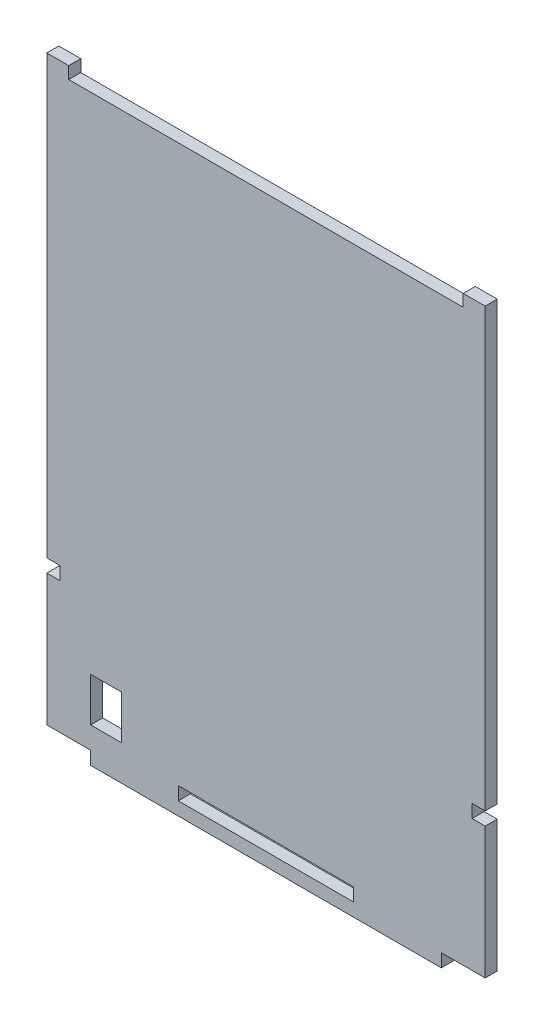
ISO-10303-21;
HEADER;
FILE_DESCRIPTION(('STEP AP214'),'2;1');
FILE_NAME('part.step','',(''),(''),'','','');
FILE_SCHEMA(('AUTOMOTIVE_DESIGN { 1 0 10303 214 1 1 1 1 }'));
ENDSEC;
DATA;
#1=APPLICATION_CONTEXT('core data for automotive mechanical design processes');
#2=APPLICATION_PROTOCOL_DEFINITION('international standard','automotive_design',2000,#1);
#3=PRODUCT_CONTEXT('',#1,'mechanical');
#4=PRODUCT('Part','Part','',(#3));
#5=PRODUCT_RELATED_PRODUCT_CATEGORY('part','',(#4));
#6=PRODUCT_DEFINITION_FORMATION('','',#4);
#7=PRODUCT_DEFINITION_CONTEXT('part definition',#1,'design');
#8=PRODUCT_DEFINITION('design','',#6,#7);
#9=PRODUCT_DEFINITION_SHAPE('','',#8);
#10=(LENGTH_UNIT() NAMED_UNIT(*) SI_UNIT(.MILLI.,.METRE.));
#11=(NAMED_UNIT(*) PLANE_ANGLE_UNIT() SI_UNIT($,.RADIAN.));
#12=(NAMED_UNIT(*) SI_UNIT($,.STERADIAN.) SOLID_ANGLE_UNIT());
#13=UNCERTAINTY_MEASURE_WITH_UNIT(LENGTH_MEASURE(1.E-05),#10,'distance_accuracy_value','');
#14=(GEOMETRIC_REPRESENTATION_CONTEXT(3) GLOBAL_UNCERTAINTY_ASSIGNED_CONTEXT((#13)) GLOBAL_UNIT_ASSIGNED_CONTEXT((#10,
#11,#12)) REPRESENTATION_CONTEXT('',''));
#15=CARTESIAN_POINT('',(0.,0.,0.));
#16=DIRECTION('',(0.,0.,1.));
#17=DIRECTION('',(1.,0.,0.));
#18=AXIS2_PLACEMENT_3D('',#15,#16,#17);
#19=CARTESIAN_POINT('',(70.,0.,2.75));
#20=DIRECTION('',(1.,0.,0.));
#21=DIRECTION('',(0.,0.,-1.));
#22=AXIS2_PLACEMENT_3D('',#19,#20,#21);
#23=PLANE('',#22);
#24=DIRECTION('',(0.,-1.,0.));
#25=VECTOR('',#24,1.);
#26=CARTESIAN_POINT('',(70.,0.,0.));
#27=LINE('',#26,#25);
#28=CARTESIAN_POINT('',(70.,-27.,0.));
#29=VERTEX_POINT('',#28);
#30=CARTESIAN_POINT('',(70.,-30.,0.));
#31=VERTEX_POINT('',#30);
#32=EDGE_CURVE('E418',#29,#31,#27,.T.);
#33=ORIENTED_EDGE('',*,*,#32,.T.);
#34=DIRECTION('',(0.,0.,-1.));
#35=VECTOR('',#34,1.);
#36=CARTESIAN_POINT('',(70.,-30.,2.75));
#37=LINE('',#36,#35);
#38=CARTESIAN_POINT('',(70.,-30.,2.75));
#39=VERTEX_POINT('',#38);
#40=EDGE_CURVE('E443',#39,#31,#37,.T.);
#41=ORIENTED_EDGE('',*,*,#40,.F.);
#42=DIRECTION('',(0.,-1.,0.));
#43=VECTOR('',#42,1.);
#44=CARTESIAN_POINT('',(70.,0.,2.75));
#45=LINE('',#44,#43);
#46=CARTESIAN_POINT('',(70.,-27.,2.75));
#47=VERTEX_POINT('',#46);
#48=EDGE_CURVE('E331',#47,#39,#45,.T.);
#49=ORIENTED_EDGE('',*,*,#48,.F.);
#50=DIRECTION('',(0.,0.,-1.));
#51=VECTOR('',#50,1.);
#52=CARTESIAN_POINT('',(70.,-27.,2.75));
#53=LINE('',#52,#51);
#54=EDGE_CURVE('E433',#47,#29,#53,.T.);
#55=ORIENTED_EDGE('',*,*,#54,.T.);
#56=EDGE_LOOP('',(#33,#41,#49,#55));
#57=FACE_BOUND('',#56,.T.);
#58=ADVANCED_FACE('F41',(#57),#23,.F.);
#59=CARTESIAN_POINT('',(0.,-30.,2.75));
#60=DIRECTION('',(0.,1.,0.));
#61=DIRECTION('',(0.,0.,1.));
#62=AXIS2_PLACEMENT_3D('',#59,#60,#61);
#63=PLANE('',#62);
#64=DIRECTION('',(1.,0.,0.));
#65=VECTOR('',#64,1.);
#66=CARTESIAN_POINT('',(0.,-30.,0.));
#67=LINE('',#66,#65);
#68=CARTESIAN_POINT('',(30.,-30.,0.));
#69=VERTEX_POINT('',#68);
#70=EDGE_CURVE('E422',#69,#31,#67,.T.);
#71=ORIENTED_EDGE('',*,*,#70,.F.);
#72=DIRECTION('',(0.,0.,-1.));
#73=VECTOR('',#72,1.);
#74=CARTESIAN_POINT('',(30.,-30.,2.75));
#75=LINE('',#74,#73);
#76=CARTESIAN_POINT('',(30.,-30.,2.75));
#77=VERTEX_POINT('',#76);
#78=EDGE_CURVE('E440',#77,#69,#75,.T.);
#79=ORIENTED_EDGE('',*,*,#78,.F.);
#80=DIRECTION('',(1.,0.,0.));
#81=VECTOR('',#80,1.);
#82=CARTESIAN_POINT('',(0.,-30.,2.75));
#83=LINE('',#82,#81);
#84=EDGE_CURVE('E334',#77,#39,#83,.T.);
#85=ORIENTED_EDGE('',*,*,#84,.T.);
#86=ORIENTED_EDGE('',*,*,#40,.T.);
#87=EDGE_LOOP('',(#71,#79,#85,#86));
#88=FACE_BOUND('',#87,.T.);
#89=ADVANCED_FACE('F533',(#88),#63,.T.);
#90=CARTESIAN_POINT('',(30.,0.,2.75));
#91=DIRECTION('',(1.,0.,0.));
#92=DIRECTION('',(0.,0.,-1.));
#93=AXIS2_PLACEMENT_3D('',#90,#91,#92);
#94=PLANE('',#93);
#95=DIRECTION('',(0.,-1.,0.));
#96=VECTOR('',#95,1.);
#97=CARTESIAN_POINT('',(30.,0.,0.));
#98=LINE('',#97,#96);
#99=CARTESIAN_POINT('',(30.,-27.,0.));
#100=VERTEX_POINT('',#99);
#101=EDGE_CURVE('E426',#100,#69,#98,.T.);
#102=ORIENTED_EDGE('',*,*,#101,.F.);
#103=DIRECTION('',(0.,0.,-1.));
#104=VECTOR('',#103,1.);
#105=CARTESIAN_POINT('',(30.,-27.,2.75));
#106=LINE('',#105,#104);
#107=CARTESIAN_POINT('',(30.,-27.,2.75));
#108=VERTEX_POINT('',#107);
#109=EDGE_CURVE('E436',#108,#100,#106,.T.);
#110=ORIENTED_EDGE('',*,*,#109,.F.);
#111=DIRECTION('',(0.,-1.,0.));
#112=VECTOR('',#111,1.);
#113=CARTESIAN_POINT('',(30.,0.,2.75));
#114=LINE('',#113,#112);
#115=EDGE_CURVE('E338',#108,#77,#114,.T.);
#116=ORIENTED_EDGE('',*,*,#115,.T.);
#117=ORIENTED_EDGE('',*,*,#78,.T.);
#118=EDGE_LOOP('',(#102,#110,#116,#117));
#119=FACE_BOUND('',#118,.T.);
#120=ADVANCED_FACE('F539',(#119),#94,.T.);
#121=CARTESIAN_POINT('',(90.,0.,2.75));
#122=DIRECTION('',(1.,0.,0.));
#123=DIRECTION('',(0.,0.,-1.));
#124=AXIS2_PLACEMENT_3D('',#121,#122,#123);
#125=PLANE('',#124);
#126=DIRECTION('',(0.,-1.,0.));
#127=VECTOR('',#126,1.);
#128=CARTESIAN_POINT('',(90.,0.,0.));
#129=LINE('',#128,#127);
#130=CARTESIAN_POINT('',(90.,-30.,0.));
#131=VERTEX_POINT('',#130);
#132=CARTESIAN_POINT('',(90.,-33.,0.));
#133=VERTEX_POINT('',#132);
#134=EDGE_CURVE('E258',#131,#133,#129,.T.);
#135=ORIENTED_EDGE('',*,*,#134,.F.);
#136=DIRECTION('',(0.,0.,-1.));
#137=VECTOR('',#136,1.);
#138=CARTESIAN_POINT('',(90.,-30.,2.75));
#139=LINE('',#138,#137);
#140=CARTESIAN_POINT('',(90.,-30.,2.75));
#141=VERTEX_POINT('',#140);
#142=EDGE_CURVE('E437',#141,#131,#139,.T.);
#143=ORIENTED_EDGE('',*,*,#142,.F.);
#144=DIRECTION('',(0.,-1.,0.));
#145=VECTOR('',#144,1.);
#146=CARTESIAN_POINT('',(90.,0.,2.75));
#147=LINE('',#146,#145);
#148=CARTESIAN_POINT('',(90.,-33.,2.75));
#149=VERTEX_POINT('',#148);
#150=EDGE_CURVE('E263',#141,#149,#147,.T.);
#151=ORIENTED_EDGE('',*,*,#150,.T.);
#152=DIRECTION('',(0.,0.,-1.));
#153=VECTOR('',#152,1.);
#154=CARTESIAN_POINT('',(90.,-33.,2.75));
#155=LINE('',#154,#153);
#156=EDGE_CURVE('E346',#149,#133,#155,.T.);
#157=ORIENTED_EDGE('',*,*,#156,.T.);
#158=EDGE_LOOP('',(#135,#143,#151,#157));
#159=FACE_BOUND('',#158,.T.);
#160=ADVANCED_FACE('F43',(#159),#125,.T.);
#161=CARTESIAN_POINT('',(0.,-30.,2.75));
#162=DIRECTION('',(0.,1.,0.));
#163=DIRECTION('',(0.,0.,1.));
#164=AXIS2_PLACEMENT_3D('',#161,#162,#163);
#165=PLANE('',#164);
#166=DIRECTION('',(1.,0.,0.));
#167=VECTOR('',#166,1.);
#168=CARTESIAN_POINT('',(0.,-30.,0.));
#169=LINE('',#168,#167);
#170=CARTESIAN_POINT('',(100.,-30.,0.));
#171=VERTEX_POINT('',#170);
#172=EDGE_CURVE('E350',#131,#171,#169,.T.);
#173=ORIENTED_EDGE('',*,*,#172,.T.);
#174=DIRECTION('',(0.,0.,-1.));
#175=VECTOR('',#174,1.);
#176=CARTESIAN_POINT('',(100.,-30.,2.75));
#177=LINE('',#176,#175);
#178=CARTESIAN_POINT('',(100.,-30.,2.75));
#179=VERTEX_POINT('',#178);
#180=EDGE_CURVE('E505',#179,#171,#177,.T.);
#181=ORIENTED_EDGE('',*,*,#180,.F.);
#182=DIRECTION('',(1.,0.,0.));
#183=VECTOR('',#182,1.);
#184=CARTESIAN_POINT('',(0.,-30.,2.75));
#185=LINE('',#184,#183);
#186=EDGE_CURVE('E267',#141,#179,#185,.T.);
#187=ORIENTED_EDGE('',*,*,#186,.F.);
#188=ORIENTED_EDGE('',*,*,#142,.T.);
#189=EDGE_LOOP('',(#173,#181,#187,#188));
#190=FACE_BOUND('',#189,.T.);
#191=ADVANCED_FACE('F612',(#190),#165,.F.);
#192=CARTESIAN_POINT('',(100.,0.,2.75));
#193=DIRECTION('',(1.,0.,0.));
#194=DIRECTION('',(0.,0.,-1.));
#195=AXIS2_PLACEMENT_3D('',#192,#193,#194);
#196=PLANE('',#195);
#197=DIRECTION('',(0.,-1.,0.));
#198=VECTOR('',#197,1.);
#199=CARTESIAN_POINT('',(100.,0.,0.));
#200=LINE('',#199,#198);
#201=CARTESIAN_POINT('',(100.,0.,0.));
#202=VERTEX_POINT('',#201);
#203=EDGE_CURVE('E354',#202,#171,#200,.T.);
#204=ORIENTED_EDGE('',*,*,#203,.F.);
#205=DIRECTION('',(0.,0.,-1.));
#206=VECTOR('',#205,1.);
#207=CARTESIAN_POINT('',(100.,0.,2.75));
#208=LINE('',#207,#206);
#209=CARTESIAN_POINT('',(100.,0.,2.75));
#210=VERTEX_POINT('',#209);
#211=EDGE_CURVE('E502',#210,#202,#208,.T.);
#212=ORIENTED_EDGE('',*,*,#211,.F.);
#213=DIRECTION('',(0.,-1.,0.));
#214=VECTOR('',#213,1.);
#215=CARTESIAN_POINT('',(100.,0.,2.75));
#216=LINE('',#215,#214);
#217=EDGE_CURVE('E271',#210,#179,#216,.T.);
#218=ORIENTED_EDGE('',*,*,#217,.T.);
#219=ORIENTED_EDGE('',*,*,#180,.T.);
#220=EDGE_LOOP('',(#204,#212,#218,#219));
#221=FACE_BOUND('',#220,.T.);
#222=ADVANCED_FACE('F610',(#221),#196,.T.);
#223=CARTESIAN_POINT('',(0.,0.,2.75));
#224=DIRECTION('',(0.,1.,0.));
#225=DIRECTION('',(0.,0.,1.));
#226=AXIS2_PLACEMENT_3D('',#223,#224,#225);
#227=PLANE('',#226);
#228=DIRECTION('',(1.,0.,0.));
#229=VECTOR('',#228,1.);
#230=CARTESIAN_POINT('',(0.,0.,0.));
#231=LINE('',#230,#229);
#232=CARTESIAN_POINT('',(97.,0.,0.));
#233=VERTEX_POINT('',#232);
#234=EDGE_CURVE('E358',#233,#202,#231,.T.);
#235=ORIENTED_EDGE('',*,*,#234,.F.);
#236=DIRECTION('',(0.,0.,-1.));
#237=VECTOR('',#236,1.);
#238=CARTESIAN_POINT('',(97.,0.,2.75));
#239=LINE('',#238,#237);
#240=CARTESIAN_POINT('',(97.,0.,2.75));
#241=VERTEX_POINT('',#240);
#242=EDGE_CURVE('E499',#241,#233,#239,.T.);
#243=ORIENTED_EDGE('',*,*,#242,.F.);
#244=DIRECTION('',(1.,0.,0.));
#245=VECTOR('',#244,1.);
#246=CARTESIAN_POINT('',(0.,0.,2.75));
#247=LINE('',#246,#245);
#248=EDGE_CURVE('E275',#241,#210,#247,.T.);
#249=ORIENTED_EDGE('',*,*,#248,.T.);
#250=ORIENTED_EDGE('',*,*,#211,.T.);
#251=EDGE_LOOP('',(#235,#243,#249,#250));
#252=FACE_BOUND('',#251,.T.);
#253=ADVANCED_FACE('F566',(#252),#227,.T.);
#254=CARTESIAN_POINT('',(97.,0.,2.75));
#255=DIRECTION('',(-1.,0.,0.));
#256=DIRECTION('',(0.,0.,1.));
#257=AXIS2_PLACEMENT_3D('',#254,#255,#256);
#258=PLANE('',#257);
#259=DIRECTION('',(0.,1.,0.));
#260=VECTOR('',#259,1.);
#261=CARTESIAN_POINT('',(97.,0.,0.));
#262=LINE('',#261,#260);
#263=CARTESIAN_POINT('',(97.,3.,0.));
#264=VERTEX_POINT('',#263);
#265=EDGE_CURVE('E362',#233,#264,#262,.T.);
#266=ORIENTED_EDGE('',*,*,#265,.T.);
#267=DIRECTION('',(0.,0.,-1.));
#268=VECTOR('',#267,1.);
#269=CARTESIAN_POINT('',(97.,3.,2.75));
#270=LINE('',#269,#268);
#271=CARTESIAN_POINT('',(97.,3.,2.75));
#272=VERTEX_POINT('',#271);
#273=EDGE_CURVE('E496',#272,#264,#270,.T.);
#274=ORIENTED_EDGE('',*,*,#273,.F.);
#275=DIRECTION('',(0.,1.,0.));
#276=VECTOR('',#275,1.);
#277=CARTESIAN_POINT('',(97.,0.,2.75));
#278=LINE('',#277,#276);
#279=EDGE_CURVE('E279',#241,#272,#278,.T.);
#280=ORIENTED_EDGE('',*,*,#279,.F.);
#281=ORIENTED_EDGE('',*,*,#242,.T.);
#282=EDGE_LOOP('',(#266,#274,#280,#281));
#283=FACE_BOUND('',#282,.T.);
#284=ADVANCED_FACE('F605',(#283),#258,.F.);
#285=CARTESIAN_POINT('',(0.,3.,2.75));
#286=DIRECTION('',(0.,-1.,0.));
#287=DIRECTION('',(0.,0.,-1.));
#288=AXIS2_PLACEMENT_3D('',#285,#286,#287);
#289=PLANE('',#288);
#290=DIRECTION('',(-1.,0.,0.));
#291=VECTOR('',#290,1.);
#292=CARTESIAN_POINT('',(0.,3.,0.));
#293=LINE('',#292,#291);
#294=CARTESIAN_POINT('',(100.,3.,0.));
#295=VERTEX_POINT('',#294);
#296=EDGE_CURVE('E367',#295,#264,#293,.T.);
#297=ORIENTED_EDGE('',*,*,#296,.F.);
#298=DIRECTION('',(0.,0.,-1.));
#299=VECTOR('',#298,1.);
#300=CARTESIAN_POINT('',(100.,3.,2.75));
#301=LINE('',#300,#299);
#302=CARTESIAN_POINT('',(100.,3.,2.75));
#303=VERTEX_POINT('',#302);
#304=EDGE_CURVE('E493',#303,#295,#301,.T.);
#305=ORIENTED_EDGE('',*,*,#304,.F.);
#306=DIRECTION('',(-1.,0.,0.));
#307=VECTOR('',#306,1.);
#308=CARTESIAN_POINT('',(0.,3.,2.75));
#309=LINE('',#308,#307);
#310=EDGE_CURVE('E283',#303,#272,#309,.T.);
#311=ORIENTED_EDGE('',*,*,#310,.T.);
#312=ORIENTED_EDGE('',*,*,#273,.T.);
#313=EDGE_LOOP('',(#297,#305,#311,#312));
#314=FACE_BOUND('',#313,.T.);
#315=ADVANCED_FACE('F601',(#314),#289,.T.);
#316=CARTESIAN_POINT('',(100.,0.,2.75));
#317=DIRECTION('',(-1.,0.,0.));
#318=DIRECTION('',(0.,0.,1.));
#319=AXIS2_PLACEMENT_3D('',#316,#317,#318);
#320=PLANE('',#319);
#321=DIRECTION('',(0.,1.,0.));
#322=VECTOR('',#321,1.);
#323=CARTESIAN_POINT('',(100.,0.,0.));
#324=LINE('',#323,#322);
#325=CARTESIAN_POINT('',(100.,102.75,0.));
#326=VERTEX_POINT('',#325);
#327=EDGE_CURVE('E371',#295,#326,#324,.T.);
#328=ORIENTED_EDGE('',*,*,#327,.T.);
#329=DIRECTION('',(0.,0.,-1.));
#330=VECTOR('',#329,1.);
#331=CARTESIAN_POINT('',(100.,102.75,2.75));
#332=LINE('',#331,#330);
#333=CARTESIAN_POINT('',(100.,102.75,2.75));
#334=VERTEX_POINT('',#333);
#335=EDGE_CURVE('E489',#334,#326,#332,.T.);
#336=ORIENTED_EDGE('',*,*,#335,.F.);
#337=DIRECTION('',(0.,1.,0.));
#338=VECTOR('',#337,1.);
#339=CARTESIAN_POINT('',(100.,0.,2.75));
#340=LINE('',#339,#338);
#341=EDGE_CURVE('E287',#303,#334,#340,.T.);
#342=ORIENTED_EDGE('',*,*,#341,.F.);
#343=ORIENTED_EDGE('',*,*,#304,.T.);
#344=EDGE_LOOP('',(#328,#336,#342,#343));
#345=FACE_BOUND('',#344,.T.);
#346=ADVANCED_FACE('F597',(#345),#320,.F.);
#347=CARTESIAN_POINT('',(0.,102.75,2.75));
#348=DIRECTION('',(0.,-1.,0.));
#349=DIRECTION('',(0.,0.,-1.));
#350=AXIS2_PLACEMENT_3D('',#347,#348,#349);
#351=PLANE('',#350);
#352=DIRECTION('',(-1.,0.,0.));
#353=VECTOR('',#352,1.);
#354=CARTESIAN_POINT('',(0.,102.75,0.));
#355=LINE('',#354,#353);
#356=CARTESIAN_POINT('',(95.,102.75,0.));
#357=VERTEX_POINT('',#356);
#358=EDGE_CURVE('E374',#326,#357,#355,.T.);
#359=ORIENTED_EDGE('',*,*,#358,.T.);
#360=DIRECTION('',(0.,0.,-1.));
#361=VECTOR('',#360,1.);
#362=CARTESIAN_POINT('',(95.,102.75,2.75));
#363=LINE('',#362,#361);
#364=CARTESIAN_POINT('',(95.,102.75,2.75));
#365=VERTEX_POINT('',#364);
#366=EDGE_CURVE('E485',#365,#357,#363,.T.);
#367=ORIENTED_EDGE('',*,*,#366,.F.);
#368=DIRECTION('',(-1.,0.,0.));
#369=VECTOR('',#368,1.);
#370=CARTESIAN_POINT('',(0.,102.75,2.75));
#371=LINE('',#370,#369);
#372=EDGE_CURVE('E290',#334,#365,#371,.T.);
#373=ORIENTED_EDGE('',*,*,#372,.F.);
#374=ORIENTED_EDGE('',*,*,#335,.T.);
#375=EDGE_LOOP('',(#359,#367,#373,#374));
#376=FACE_BOUND('',#375,.T.);
#377=ADVANCED_FACE('F593',(#376),#351,.F.);
#378=CARTESIAN_POINT('',(95.,0.,2.75));
#379=DIRECTION('',(1.,0.,0.));
#380=DIRECTION('',(0.,0.,-1.));
#381=AXIS2_PLACEMENT_3D('',#378,#379,#380);
#382=PLANE('',#381);
#383=DIRECTION('',(0.,-1.,0.));
#384=VECTOR('',#383,1.);
#385=CARTESIAN_POINT('',(95.,0.,0.));
#386=LINE('',#385,#384);
#387=CARTESIAN_POINT('',(95.,100.,0.));
#388=VERTEX_POINT('',#387);
#389=EDGE_CURVE('E377',#357,#388,#386,.T.);
#390=ORIENTED_EDGE('',*,*,#389,.T.);
#391=DIRECTION('',(0.,0.,-1.));
#392=VECTOR('',#391,1.);
#393=CARTESIAN_POINT('',(95.,100.,2.75));
#394=LINE('',#393,#392);
#395=CARTESIAN_POINT('',(95.,100.,2.75));
#396=VERTEX_POINT('',#395);
#397=EDGE_CURVE('E482',#396,#388,#394,.T.);
#398=ORIENTED_EDGE('',*,*,#397,.F.);
#399=DIRECTION('',(0.,-1.,0.));
#400=VECTOR('',#399,1.);
#401=CARTESIAN_POINT('',(95.,0.,2.75));
#402=LINE('',#401,#400);
#403=EDGE_CURVE('E293',#365,#396,#402,.T.);
#404=ORIENTED_EDGE('',*,*,#403,.F.);
#405=ORIENTED_EDGE('',*,*,#366,.T.);
#406=EDGE_LOOP('',(#390,#398,#404,#405));
#407=FACE_BOUND('',#406,.T.);
#408=ADVANCED_FACE('F589',(#407),#382,.F.);
#409=CARTESIAN_POINT('',(0.,100.,2.75));
#410=DIRECTION('',(0.,1.,0.));
#411=DIRECTION('',(0.,0.,1.));
#412=AXIS2_PLACEMENT_3D('',#409,#410,#411);
#413=PLANE('',#412);
#414=DIRECTION('',(1.,0.,0.));
#415=VECTOR('',#414,1.);
#416=CARTESIAN_POINT('',(0.,100.,0.));
#417=LINE('',#416,#415);
#418=CARTESIAN_POINT('',(5.,100.,0.));
#419=VERTEX_POINT('',#418);
#420=EDGE_CURVE('E381',#419,#388,#417,.T.);
#421=ORIENTED_EDGE('',*,*,#420,.F.);
#422=DIRECTION('',(0.,0.,-1.));
#423=VECTOR('',#422,1.);
#424=CARTESIAN_POINT('',(5.,100.,2.75));
#425=LINE('',#424,#423);
#426=CARTESIAN_POINT('',(5.,100.,2.75));
#427=VERTEX_POINT('',#426);
#428=EDGE_CURVE('E479',#427,#419,#425,.T.);
#429=ORIENTED_EDGE('',*,*,#428,.F.);
#430=DIRECTION('',(1.,0.,0.));
#431=VECTOR('',#430,1.);
#432=CARTESIAN_POINT('',(0.,100.,2.75));
#433=LINE('',#432,#431);
#434=EDGE_CURVE('E296',#427,#396,#433,.T.);
#435=ORIENTED_EDGE('',*,*,#434,.T.);
#436=ORIENTED_EDGE('',*,*,#397,.T.);
#437=EDGE_LOOP('',(#421,#429,#435,#436));
#438=FACE_BOUND('',#437,.T.);
#439=ADVANCED_FACE('F585',(#438),#413,.T.);
#440=CARTESIAN_POINT('',(5.,0.,2.75));
#441=DIRECTION('',(1.,0.,0.));
#442=DIRECTION('',(0.,0.,-1.));
#443=AXIS2_PLACEMENT_3D('',#440,#441,#442);
#444=PLANE('',#443);
#445=DIRECTION('',(0.,-1.,0.));
#446=VECTOR('',#445,1.);
#447=CARTESIAN_POINT('',(5.,0.,0.));
#448=LINE('',#447,#446);
#449=CARTESIAN_POINT('',(5.,102.75,0.));
#450=VERTEX_POINT('',#449);
#451=EDGE_CURVE('E385',#450,#419,#448,.T.);
#452=ORIENTED_EDGE('',*,*,#451,.F.);
#453=DIRECTION('',(0.,0.,-1.));
#454=VECTOR('',#453,1.);
#455=CARTESIAN_POINT('',(5.,102.75,2.75));
#456=LINE('',#455,#454);
#457=CARTESIAN_POINT('',(5.,102.75,2.75));
#458=VERTEX_POINT('',#457);
#459=EDGE_CURVE('E476',#458,#450,#456,.T.);
#460=ORIENTED_EDGE('',*,*,#459,.F.);
#461=DIRECTION('',(0.,-1.,0.));
#462=VECTOR('',#461,1.);
#463=CARTESIAN_POINT('',(5.,0.,2.75));
#464=LINE('',#463,#462);
#465=EDGE_CURVE('E300',#458,#427,#464,.T.);
#466=ORIENTED_EDGE('',*,*,#465,.T.);
#467=ORIENTED_EDGE('',*,*,#428,.T.);
#468=EDGE_LOOP('',(#452,#460,#466,#467));
#469=FACE_BOUND('',#468,.T.);
#470=ADVANCED_FACE('F581',(#469),#444,.T.);
#471=CARTESIAN_POINT('',(0.,102.75,2.75));
#472=DIRECTION('',(0.,1.,0.));
#473=DIRECTION('',(0.,0.,1.));
#474=AXIS2_PLACEMENT_3D('',#471,#472,#473);
#475=PLANE('',#474);
#476=DIRECTION('',(1.,0.,0.));
#477=VECTOR('',#476,1.);
#478=CARTESIAN_POINT('',(0.,102.75,0.));
#479=LINE('',#478,#477);
#480=CARTESIAN_POINT('',(0.,102.75,0.));
#481=VERTEX_POINT('',#480);
#482=EDGE_CURVE('E389',#481,#450,#479,.T.);
#483=ORIENTED_EDGE('',*,*,#482,.F.);
#484=DIRECTION('',(0.,0.,-1.));
#485=VECTOR('',#484,1.);
#486=CARTESIAN_POINT('',(0.,102.75,2.75));
#487=LINE('',#486,#485);
#488=CARTESIAN_POINT('',(0.,102.75,2.75));
#489=VERTEX_POINT('',#488);
#490=EDGE_CURVE('E473',#489,#481,#487,.T.);
#491=ORIENTED_EDGE('',*,*,#490,.F.);
#492=DIRECTION('',(1.,0.,0.));
#493=VECTOR('',#492,1.);
#494=CARTESIAN_POINT('',(0.,102.75,2.75));
#495=LINE('',#494,#493);
#496=EDGE_CURVE('E304',#489,#458,#495,.T.);
#497=ORIENTED_EDGE('',*,*,#496,.T.);
#498=ORIENTED_EDGE('',*,*,#459,.T.);
#499=EDGE_LOOP('',(#483,#491,#497,#498));
#500=FACE_BOUND('',#499,.T.);
#501=ADVANCED_FACE('F577',(#500),#475,.T.);
#502=CARTESIAN_POINT('',(0.,0.,2.75));
#503=DIRECTION('',(-1.,0.,0.));
#504=DIRECTION('',(0.,0.,1.));
#505=AXIS2_PLACEMENT_3D('',#502,#503,#504);
#506=PLANE('',#505);
#507=DIRECTION('',(0.,1.,0.));
#508=VECTOR('',#507,1.);
#509=CARTESIAN_POINT('',(0.,0.,0.));
#510=LINE('',#509,#508);
#511=CARTESIAN_POINT('',(0.,3.,0.));
#512=VERTEX_POINT('',#511);
#513=EDGE_CURVE('E393',#512,#481,#510,.T.);
#514=ORIENTED_EDGE('',*,*,#513,.F.);
#515=DIRECTION('',(0.,0.,-1.));
#516=VECTOR('',#515,1.);
#517=CARTESIAN_POINT('',(0.,3.,2.75));
#518=LINE('',#517,#516);
#519=CARTESIAN_POINT('',(0.,3.,2.75));
#520=VERTEX_POINT('',#519);
#521=EDGE_CURVE('E470',#520,#512,#518,.T.);
#522=ORIENTED_EDGE('',*,*,#521,.F.);
#523=DIRECTION('',(0.,1.,0.));
#524=VECTOR('',#523,1.);
#525=CARTESIAN_POINT('',(0.,0.,2.75));
#526=LINE('',#525,#524);
#527=EDGE_CURVE('E308',#520,#489,#526,.T.);
#528=ORIENTED_EDGE('',*,*,#527,.T.);
#529=ORIENTED_EDGE('',*,*,#490,.T.);
#530=EDGE_LOOP('',(#514,#522,#528,#529));
#531=FACE_BOUND('',#530,.T.);
#532=ADVANCED_FACE('F573',(#531),#506,.T.);
#533=CARTESIAN_POINT('',(0.,3.,2.75));
#534=DIRECTION('',(0.,1.,0.));
#535=DIRECTION('',(0.,0.,1.));
#536=AXIS2_PLACEMENT_3D('',#533,#534,#535);
#537=PLANE('',#536);
#538=DIRECTION('',(1.,0.,0.));
#539=VECTOR('',#538,1.);
#540=CARTESIAN_POINT('',(0.,3.,0.));
#541=LINE('',#540,#539);
#542=CARTESIAN_POINT('',(3.,3.,0.));
#543=VERTEX_POINT('',#542);
#544=EDGE_CURVE('E397',#512,#543,#541,.T.);
#545=ORIENTED_EDGE('',*,*,#544,.T.);
#546=DIRECTION('',(0.,0.,-1.));
#547=VECTOR('',#546,1.);
#548=CARTESIAN_POINT('',(3.,3.,2.75));
#549=LINE('',#548,#547);
#550=CARTESIAN_POINT('',(3.,3.,2.75));
#551=VERTEX_POINT('',#550);
#552=EDGE_CURVE('E467',#551,#543,#549,.T.);
#553=ORIENTED_EDGE('',*,*,#552,.F.);
#554=DIRECTION('',(1.,0.,0.));
#555=VECTOR('',#554,1.);
#556=CARTESIAN_POINT('',(0.,3.,2.75));
#557=LINE('',#556,#555);
#558=EDGE_CURVE('E312',#520,#551,#557,.T.);
#559=ORIENTED_EDGE('',*,*,#558,.F.);
#560=ORIENTED_EDGE('',*,*,#521,.T.);
#561=EDGE_LOOP('',(#545,#553,#559,#560));
#562=FACE_BOUND('',#561,.T.);
#563=ADVANCED_FACE('F569',(#562),#537,.F.);
#564=CARTESIAN_POINT('',(3.,0.,2.75));
#565=DIRECTION('',(-1.,0.,0.));
#566=DIRECTION('',(0.,0.,1.));
#567=AXIS2_PLACEMENT_3D('',#564,#565,#566);
#568=PLANE('',#567);
#569=DIRECTION('',(0.,1.,0.));
#570=VECTOR('',#569,1.);
#571=CARTESIAN_POINT('',(3.,0.,0.));
#572=LINE('',#571,#570);
#573=CARTESIAN_POINT('',(3.,0.,0.));
#574=VERTEX_POINT('',#573);
#575=EDGE_CURVE('E401',#574,#543,#572,.T.);
#576=ORIENTED_EDGE('',*,*,#575,.F.);
#577=DIRECTION('',(0.,0.,-1.));
#578=VECTOR('',#577,1.);
#579=CARTESIAN_POINT('',(3.,0.,2.75));
#580=LINE('',#579,#578);
#581=CARTESIAN_POINT('',(3.,0.,2.75));
#582=VERTEX_POINT('',#581);
#583=EDGE_CURVE('E464',#582,#574,#580,.T.);
#584=ORIENTED_EDGE('',*,*,#583,.F.);
#585=DIRECTION('',(0.,1.,0.));
#586=VECTOR('',#585,1.);
#587=CARTESIAN_POINT('',(3.,0.,2.75));
#588=LINE('',#587,#586);
#589=EDGE_CURVE('E315',#582,#551,#588,.T.);
#590=ORIENTED_EDGE('',*,*,#589,.T.);
#591=ORIENTED_EDGE('',*,*,#552,.T.);
#592=EDGE_LOOP('',(#576,#584,#590,#591));
#593=FACE_BOUND('',#592,.T.);
#594=ADVANCED_FACE('F564',(#593),#568,.T.);
#595=CARTESIAN_POINT('',(0.,0.,0.));
#596=VERTEX_POINT('',#595);
#597=EDGE_CURVE('E363',#596,#574,#231,.T.);
#598=ORIENTED_EDGE('',*,*,#597,.F.);
#599=DIRECTION('',(0.,0.,-1.));
#600=VECTOR('',#599,1.);
#601=CARTESIAN_POINT('',(0.,0.,2.75));
#602=LINE('',#601,#600);
#603=CARTESIAN_POINT('',(0.,0.,2.75));
#604=VERTEX_POINT('',#603);
#605=EDGE_CURVE('E461',#604,#596,#602,.T.);
#606=ORIENTED_EDGE('',*,*,#605,.F.);
#607=EDGE_CURVE('E280',#604,#582,#247,.T.);
#608=ORIENTED_EDGE('',*,*,#607,.T.);
#609=ORIENTED_EDGE('',*,*,#583,.T.);
#610=EDGE_LOOP('',(#598,#606,#608,#609));
#611=FACE_BOUND('',#610,.T.);
#612=ADVANCED_FACE('F560',(#611),#227,.T.);
#613=CARTESIAN_POINT('',(0.,0.,2.75));
#614=DIRECTION('',(1.,0.,0.));
#615=DIRECTION('',(0.,0.,-1.));
#616=AXIS2_PLACEMENT_3D('',#613,#614,#615);
#617=PLANE('',#616);
#618=DIRECTION('',(0.,-1.,0.));
#619=VECTOR('',#618,1.);
#620=CARTESIAN_POINT('',(0.,0.,0.));
#621=LINE('',#620,#619);
#622=CARTESIAN_POINT('',(0.,-30.,0.));
#623=VERTEX_POINT('',#622);
#624=EDGE_CURVE('E405',#596,#623,#621,.T.);
#625=ORIENTED_EDGE('',*,*,#624,.T.);
#626=DIRECTION('',(0.,0.,-1.));
#627=VECTOR('',#626,1.);
#628=CARTESIAN_POINT('',(0.,-30.,2.75));
#629=LINE('',#628,#627);
#630=CARTESIAN_POINT('',(0.,-30.,2.75));
#631=VERTEX_POINT('',#630);
#632=EDGE_CURVE('E457',#631,#623,#629,.T.);
#633=ORIENTED_EDGE('',*,*,#632,.F.);
#634=DIRECTION('',(0.,-1.,0.));
#635=VECTOR('',#634,1.);
#636=CARTESIAN_POINT('',(0.,0.,2.75));
#637=LINE('',#636,#635);
#638=EDGE_CURVE('E319',#604,#631,#637,.T.);
#639=ORIENTED_EDGE('',*,*,#638,.F.);
#640=ORIENTED_EDGE('',*,*,#605,.T.);
#641=EDGE_LOOP('',(#625,#633,#639,#640));
#642=FACE_BOUND('',#641,.T.);
#643=ADVANCED_FACE('F556',(#642),#617,.F.);
#644=CARTESIAN_POINT('',(0.,-30.,2.75));
#645=DIRECTION('',(0.,1.,0.));
#646=DIRECTION('',(0.,0.,1.));
#647=AXIS2_PLACEMENT_3D('',#644,#645,#646);
#648=PLANE('',#647);
#649=DIRECTION('',(1.,0.,0.));
#650=VECTOR('',#649,1.);
#651=CARTESIAN_POINT('',(0.,-30.,0.));
#652=LINE('',#651,#650);
#653=CARTESIAN_POINT('',(10.,-30.,0.));
#654=VERTEX_POINT('',#653);
#655=EDGE_CURVE('E408',#623,#654,#652,.T.);
#656=ORIENTED_EDGE('',*,*,#655,.T.);
#657=DIRECTION('',(0.,0.,-1.));
#658=VECTOR('',#657,1.);
#659=CARTESIAN_POINT('',(10.,-30.,2.75));
#660=LINE('',#659,#658);
#661=CARTESIAN_POINT('',(10.,-30.,2.75));
#662=VERTEX_POINT('',#661);
#663=EDGE_CURVE('E453',#662,#654,#660,.T.);
#664=ORIENTED_EDGE('',*,*,#663,.F.);
#665=DIRECTION('',(1.,0.,0.));
#666=VECTOR('',#665,1.);
#667=CARTESIAN_POINT('',(0.,-30.,2.75));
#668=LINE('',#667,#666);
#669=EDGE_CURVE('E322',#631,#662,#668,.T.);
#670=ORIENTED_EDGE('',*,*,#669,.F.);
#671=ORIENTED_EDGE('',*,*,#632,.T.);
#672=EDGE_LOOP('',(#656,#664,#670,#671));
#673=FACE_BOUND('',#672,.T.);
#674=ADVANCED_FACE('F552',(#673),#648,.F.);
#675=CARTESIAN_POINT('',(10.,0.,2.75));
#676=DIRECTION('',(1.,0.,0.));
#677=DIRECTION('',(0.,0.,-1.));
#678=AXIS2_PLACEMENT_3D('',#675,#676,#677);
#679=PLANE('',#678);
#680=DIRECTION('',(0.,-1.,0.));
#681=VECTOR('',#680,1.);
#682=CARTESIAN_POINT('',(10.,0.,0.));
#683=LINE('',#682,#681);
#684=CARTESIAN_POINT('',(10.,-33.,0.));
#685=VERTEX_POINT('',#684);
#686=EDGE_CURVE('E411',#654,#685,#683,.T.);
#687=ORIENTED_EDGE('',*,*,#686,.T.);
#688=DIRECTION('',(0.,0.,-1.));
#689=VECTOR('',#688,1.);
#690=CARTESIAN_POINT('',(10.,-33.,2.75));
#691=LINE('',#690,#689);
#692=CARTESIAN_POINT('',(10.,-33.,2.75));
#693=VERTEX_POINT('',#692);
#694=EDGE_CURVE('E449',#693,#685,#691,.T.);
#695=ORIENTED_EDGE('',*,*,#694,.F.);
#696=DIRECTION('',(0.,-1.,0.));
#697=VECTOR('',#696,1.);
#698=CARTESIAN_POINT('',(10.,0.,2.75));
#699=LINE('',#698,#697);
#700=EDGE_CURVE('E325',#662,#693,#699,.T.);
#701=ORIENTED_EDGE('',*,*,#700,.F.);
#702=ORIENTED_EDGE('',*,*,#663,.T.);
#703=EDGE_LOOP('',(#687,#695,#701,#702));
#704=FACE_BOUND('',#703,.T.);
#705=ADVANCED_FACE('F548',(#704),#679,.F.);
#706=CARTESIAN_POINT('',(0.,-33.,2.75));
#707=DIRECTION('',(0.,1.,0.));
#708=DIRECTION('',(0.,0.,1.));
#709=AXIS2_PLACEMENT_3D('',#706,#707,#708);
#710=PLANE('',#709);
#711=DIRECTION('',(1.,0.,0.));
#712=VECTOR('',#711,1.);
#713=CARTESIAN_POINT('',(0.,-33.,0.));
#714=LINE('',#713,#712);
#715=EDGE_CURVE('E414',#685,#133,#714,.T.);
#716=ORIENTED_EDGE('',*,*,#715,.T.);
#717=ORIENTED_EDGE('',*,*,#156,.F.);
#718=DIRECTION('',(1.,0.,0.));
#719=VECTOR('',#718,1.);
#720=CARTESIAN_POINT('',(0.,-33.,2.75));
#721=LINE('',#720,#719);
#722=EDGE_CURVE('E328',#693,#149,#721,.T.);
#723=ORIENTED_EDGE('',*,*,#722,.F.);
#724=ORIENTED_EDGE('',*,*,#694,.T.);
#725=EDGE_LOOP('',(#716,#717,#723,#724));
#726=FACE_BOUND('',#725,.T.);
#727=ADVANCED_FACE('F544',(#726),#710,.F.);
#728=CARTESIAN_POINT('',(0.,-27.,2.75));
#729=DIRECTION('',(0.,-1.,0.));
#730=DIRECTION('',(0.,0.,-1.));
#731=AXIS2_PLACEMENT_3D('',#728,#729,#730);
#732=PLANE('',#731);
#733=DIRECTION('',(-1.,0.,0.));
#734=VECTOR('',#733,1.);
#735=CARTESIAN_POINT('',(0.,-27.,0.));
#736=LINE('',#735,#734);
#737=EDGE_CURVE('E268',#29,#100,#736,.T.);
#738=ORIENTED_EDGE('',*,*,#737,.F.);
#739=ORIENTED_EDGE('',*,*,#54,.F.);
#740=DIRECTION('',(-1.,0.,0.));
#741=VECTOR('',#740,1.);
#742=CARTESIAN_POINT('',(0.,-27.,2.75));
#743=LINE('',#742,#741);
#744=EDGE_CURVE('E342',#47,#108,#743,.T.);
#745=ORIENTED_EDGE('',*,*,#744,.T.);
#746=ORIENTED_EDGE('',*,*,#109,.T.);
#747=EDGE_LOOP('',(#738,#739,#745,#746));
#748=FACE_BOUND('',#747,.T.);
#749=ADVANCED_FACE('F547',(#748),#732,.T.);
#750=CARTESIAN_POINT('',(0.,0.,2.75));
#751=DIRECTION('',(0.,0.,1.));
#752=DIRECTION('',(1.,0.,0.));
#753=AXIS2_PLACEMENT_3D('',#750,#751,#752);
#754=PLANE('',#753);
#755=DIRECTION('',(-1.,0.,0.));
#756=VECTOR('',#755,1.);
#757=CARTESIAN_POINT('',(0.,-15.,2.75));
#758=LINE('',#757,#756);
#759=CARTESIAN_POINT('',(17.,-15.,2.75));
#760=VERTEX_POINT('',#759);
#761=CARTESIAN_POINT('',(10.,-15.,2.75));
#762=VERTEX_POINT('',#761);
#763=EDGE_CURVE('E57',#760,#762,#758,.T.);
#764=ORIENTED_EDGE('',*,*,#763,.F.);
#765=DIRECTION('',(0.,1.,0.));
#766=VECTOR('',#765,1.);
#767=CARTESIAN_POINT('',(17.,0.,2.75));
#768=LINE('',#767,#766);
#769=CARTESIAN_POINT('',(17.,-25.,2.75));
#770=VERTEX_POINT('',#769);
#771=EDGE_CURVE('E248',#770,#760,#768,.T.);
#772=ORIENTED_EDGE('',*,*,#771,.F.);
#773=DIRECTION('',(1.,0.,0.));
#774=VECTOR('',#773,1.);
#775=CARTESIAN_POINT('',(0.,-25.,2.75));
#776=LINE('',#775,#774);
#777=CARTESIAN_POINT('',(10.,-25.,2.75));
#778=VERTEX_POINT('',#777);
#779=EDGE_CURVE('E230',#778,#770,#776,.T.);
#780=ORIENTED_EDGE('',*,*,#779,.F.);
#781=DIRECTION('',(0.,-1.,0.));
#782=VECTOR('',#781,1.);
#783=CARTESIAN_POINT('',(10.,0.,2.75));
#784=LINE('',#783,#782);
#785=EDGE_CURVE('E240',#762,#778,#784,.T.);
#786=ORIENTED_EDGE('',*,*,#785,.F.);
#787=EDGE_LOOP('',(#764,#772,#780,#786));
#788=FACE_BOUND('',#787,.T.);
#789=ORIENTED_EDGE('',*,*,#150,.F.);
#790=ORIENTED_EDGE('',*,*,#186,.T.);
#791=ORIENTED_EDGE('',*,*,#217,.F.);
#792=ORIENTED_EDGE('',*,*,#248,.F.);
#793=ORIENTED_EDGE('',*,*,#279,.T.);
#794=ORIENTED_EDGE('',*,*,#310,.F.);
#795=ORIENTED_EDGE('',*,*,#341,.T.);
#796=ORIENTED_EDGE('',*,*,#372,.T.);
#797=ORIENTED_EDGE('',*,*,#403,.T.);
#798=ORIENTED_EDGE('',*,*,#434,.F.);
#799=ORIENTED_EDGE('',*,*,#465,.F.);
#800=ORIENTED_EDGE('',*,*,#496,.F.);
#801=ORIENTED_EDGE('',*,*,#527,.F.);
#802=ORIENTED_EDGE('',*,*,#558,.T.);
#803=ORIENTED_EDGE('',*,*,#589,.F.);
#804=ORIENTED_EDGE('',*,*,#607,.F.);
#805=ORIENTED_EDGE('',*,*,#638,.T.);
#806=ORIENTED_EDGE('',*,*,#669,.T.);
#807=ORIENTED_EDGE('',*,*,#700,.T.);
#808=ORIENTED_EDGE('',*,*,#722,.T.);
#809=EDGE_LOOP('',(#789,#790,#791,#792,#793,#794,#795,#796,#797,#798,#799,#800,#801,#802,#803,
#804,#805,#806,#807,#808));
#810=FACE_BOUND('',#809,.T.);
#811=ORIENTED_EDGE('',*,*,#48,.T.);
#812=ORIENTED_EDGE('',*,*,#84,.F.);
#813=ORIENTED_EDGE('',*,*,#115,.F.);
#814=ORIENTED_EDGE('',*,*,#744,.F.);
#815=EDGE_LOOP('',(#811,#812,#813,#814));
#816=FACE_BOUND('',#815,.T.);
#817=ADVANCED_FACE('F245',(#788,#810,#816),#754,.T.);
#818=CARTESIAN_POINT('',(0.,0.,0.));
#819=DIRECTION('',(0.,0.,1.));
#820=DIRECTION('',(1.,0.,0.));
#821=AXIS2_PLACEMENT_3D('',#818,#819,#820);
#822=PLANE('',#821);
#823=DIRECTION('',(0.,1.,0.));
#824=VECTOR('',#823,1.);
#825=CARTESIAN_POINT('',(17.,0.,0.));
#826=LINE('',#825,#824);
#827=CARTESIAN_POINT('',(17.,-25.,0.));
#828=VERTEX_POINT('',#827);
#829=CARTESIAN_POINT('',(17.,-15.,0.));
#830=VERTEX_POINT('',#829);
#831=EDGE_CURVE('E50',#828,#830,#826,.T.);
#832=ORIENTED_EDGE('',*,*,#831,.T.);
#833=DIRECTION('',(-1.,0.,0.));
#834=VECTOR('',#833,1.);
#835=CARTESIAN_POINT('',(0.,-15.,0.));
#836=LINE('',#835,#834);
#837=CARTESIAN_POINT('',(10.,-15.,0.));
#838=VERTEX_POINT('',#837);
#839=EDGE_CURVE('E11',#830,#838,#836,.T.);
#840=ORIENTED_EDGE('',*,*,#839,.T.);
#841=DIRECTION('',(0.,-1.,0.));
#842=VECTOR('',#841,1.);
#843=CARTESIAN_POINT('',(10.,0.,0.));
#844=LINE('',#843,#842);
#845=CARTESIAN_POINT('',(10.,-25.,0.));
#846=VERTEX_POINT('',#845);
#847=EDGE_CURVE('E446',#838,#846,#844,.T.);
#848=ORIENTED_EDGE('',*,*,#847,.T.);
#849=DIRECTION('',(1.,0.,0.));
#850=VECTOR('',#849,1.);
#851=CARTESIAN_POINT('',(0.,-25.,0.));
#852=LINE('',#851,#850);
#853=EDGE_CURVE('E233',#846,#828,#852,.T.);
#854=ORIENTED_EDGE('',*,*,#853,.T.);
#855=EDGE_LOOP('',(#832,#840,#848,#854));
#856=FACE_BOUND('',#855,.T.);
#857=ORIENTED_EDGE('',*,*,#134,.T.);
#858=ORIENTED_EDGE('',*,*,#715,.F.);
#859=ORIENTED_EDGE('',*,*,#686,.F.);
#860=ORIENTED_EDGE('',*,*,#655,.F.);
#861=ORIENTED_EDGE('',*,*,#624,.F.);
#862=ORIENTED_EDGE('',*,*,#597,.T.);
#863=ORIENTED_EDGE('',*,*,#575,.T.);
#864=ORIENTED_EDGE('',*,*,#544,.F.);
#865=ORIENTED_EDGE('',*,*,#513,.T.);
#866=ORIENTED_EDGE('',*,*,#482,.T.);
#867=ORIENTED_EDGE('',*,*,#451,.T.);
#868=ORIENTED_EDGE('',*,*,#420,.T.);
#869=ORIENTED_EDGE('',*,*,#389,.F.);
#870=ORIENTED_EDGE('',*,*,#358,.F.);
#871=ORIENTED_EDGE('',*,*,#327,.F.);
#872=ORIENTED_EDGE('',*,*,#296,.T.);
#873=ORIENTED_EDGE('',*,*,#265,.F.);
#874=ORIENTED_EDGE('',*,*,#234,.T.);
#875=ORIENTED_EDGE('',*,*,#203,.T.);
#876=ORIENTED_EDGE('',*,*,#172,.F.);
#877=EDGE_LOOP('',(#857,#858,#859,#860,#861,#862,#863,#864,#865,#866,#867,#868,#869,#870,#871,
#872,#873,#874,#875,#876));
#878=FACE_BOUND('',#877,.T.);
#879=ORIENTED_EDGE('',*,*,#32,.F.);
#880=ORIENTED_EDGE('',*,*,#737,.T.);
#881=ORIENTED_EDGE('',*,*,#101,.T.);
#882=ORIENTED_EDGE('',*,*,#70,.T.);
#883=EDGE_LOOP('',(#879,#880,#881,#882));
#884=FACE_BOUND('',#883,.T.);
#885=ADVANCED_FACE('F516',(#856,#878,#884),#822,.F.);
#886=CARTESIAN_POINT('',(0.,-15.,-7.25));
#887=DIRECTION('',(0.,1.,0.));
#888=DIRECTION('',(0.,0.,1.));
#889=AXIS2_PLACEMENT_3D('',#886,#887,#888);
#890=PLANE('',#889);
#891=DIRECTION('',(0.,0.,1.));
#892=VECTOR('',#891,1.);
#893=CARTESIAN_POINT('',(17.,-15.,-7.25));
#894=LINE('',#893,#892);
#895=EDGE_CURVE('E255',#830,#760,#894,.T.);
#896=ORIENTED_EDGE('',*,*,#895,.T.);
#897=ORIENTED_EDGE('',*,*,#763,.T.);
#898=DIRECTION('',(0.,0.,1.));
#899=VECTOR('',#898,1.);
#900=CARTESIAN_POINT('',(10.,-15.,-7.25));
#901=LINE('',#900,#899);
#902=EDGE_CURVE('E237',#838,#762,#901,.T.);
#903=ORIENTED_EDGE('',*,*,#902,.F.);
#904=ORIENTED_EDGE('',*,*,#839,.F.);
#905=EDGE_LOOP('',(#896,#897,#903,#904));
#906=FACE_BOUND('',#905,.T.);
#907=ADVANCED_FACE('F521',(#906),#890,.F.);
#908=CARTESIAN_POINT('',(17.,0.,-7.25));
#909=DIRECTION('',(1.,0.,0.));
#910=DIRECTION('',(0.,0.,-1.));
#911=AXIS2_PLACEMENT_3D('',#908,#909,#910);
#912=PLANE('',#911);
#913=DIRECTION('',(0.,0.,1.));
#914=VECTOR('',#913,1.);
#915=CARTESIAN_POINT('',(17.,-25.,-7.25));
#916=LINE('',#915,#914);
#917=EDGE_CURVE('E236',#828,#770,#916,.T.);
#918=ORIENTED_EDGE('',*,*,#917,.T.);
#919=ORIENTED_EDGE('',*,*,#771,.T.);
#920=ORIENTED_EDGE('',*,*,#895,.F.);
#921=ORIENTED_EDGE('',*,*,#831,.F.);
#922=EDGE_LOOP('',(#918,#919,#920,#921));
#923=FACE_BOUND('',#922,.T.);
#924=ADVANCED_FACE('F520',(#923),#912,.F.);
#925=CARTESIAN_POINT('',(0.,-25.,-7.25));
#926=DIRECTION('',(0.,-1.,0.));
#927=DIRECTION('',(0.,0.,-1.));
#928=AXIS2_PLACEMENT_3D('',#925,#926,#927);
#929=PLANE('',#928);
#930=DIRECTION('',(0.,0.,1.));
#931=VECTOR('',#930,1.);
#932=CARTESIAN_POINT('',(10.,-25.,-7.25));
#933=LINE('',#932,#931);
#934=EDGE_CURVE('E65',#846,#778,#933,.T.);
#935=ORIENTED_EDGE('',*,*,#934,.T.);
#936=ORIENTED_EDGE('',*,*,#779,.T.);
#937=ORIENTED_EDGE('',*,*,#917,.F.);
#938=ORIENTED_EDGE('',*,*,#853,.F.);
#939=EDGE_LOOP('',(#935,#936,#937,#938));
#940=FACE_BOUND('',#939,.T.);
#941=ADVANCED_FACE('F227',(#940),#929,.F.);
#942=CARTESIAN_POINT('',(10.,0.,-7.25));
#943=DIRECTION('',(-1.,0.,0.));
#944=DIRECTION('',(0.,0.,1.));
#945=AXIS2_PLACEMENT_3D('',#942,#943,#944);
#946=PLANE('',#945);
#947=ORIENTED_EDGE('',*,*,#902,.T.);
#948=ORIENTED_EDGE('',*,*,#785,.T.);
#949=ORIENTED_EDGE('',*,*,#934,.F.);
#950=ORIENTED_EDGE('',*,*,#847,.F.);
#951=EDGE_LOOP('',(#947,#948,#949,#950));
#952=FACE_BOUND('',#951,.T.);
#953=ADVANCED_FACE('F241',(#952),#946,.F.);
#954=CLOSED_SHELL('',(#58,#89,#120,#160,#191,#222,#253,#284,#315,#346,#377,#408,#439,#470,#501,
#532,#563,#594,#612,#643,#674,#705,#727,#749,#817,#885,#907,#924,#941,#953));
#955=MANIFOLD_SOLID_BREP('B2',#954);
#956=ADVANCED_BREP_SHAPE_REPRESENTATION('',(#18,#955),#14);
#957=SHAPE_DEFINITION_REPRESENTATION(#9,#956);
ENDSEC;
END-ISO-10303-21;
